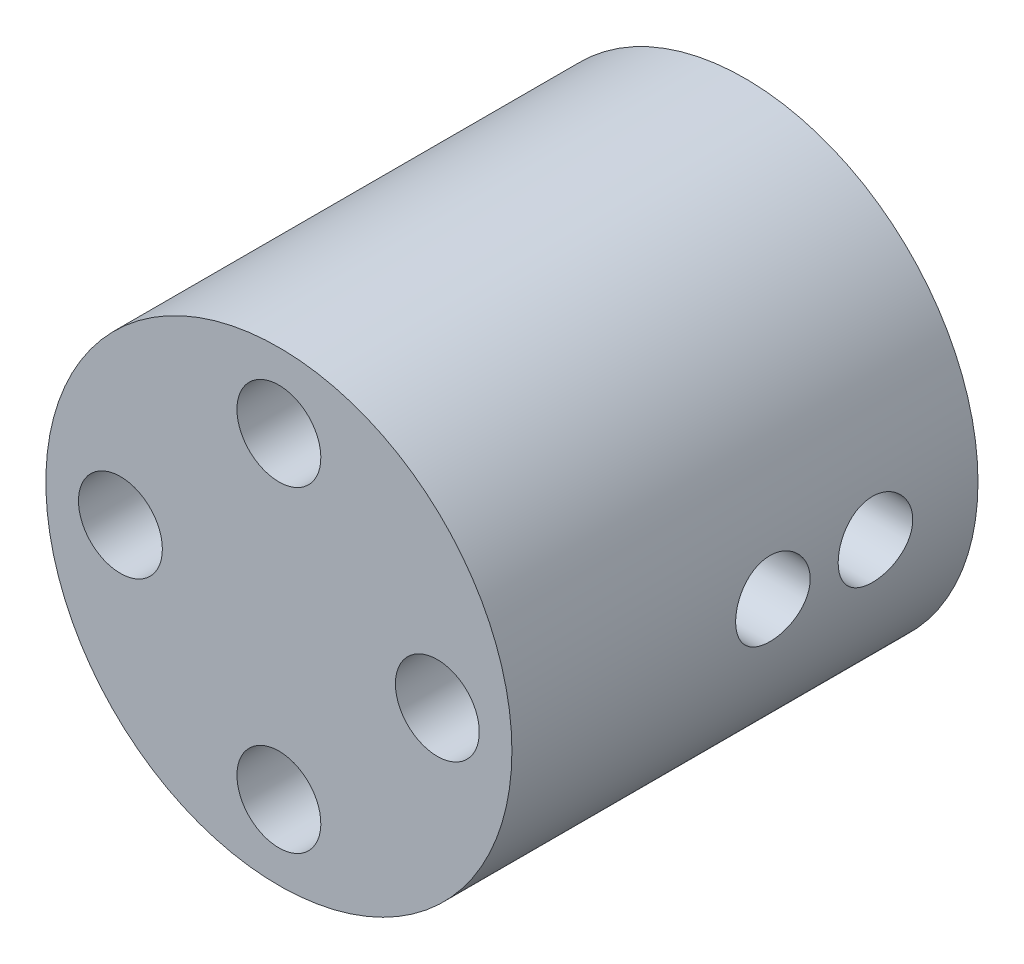
ISO-10303-21;
HEADER;
FILE_DESCRIPTION(('STEP AP214'),'2;1');
FILE_NAME('part.step','',(''),(''),'','','');
FILE_SCHEMA(('AUTOMOTIVE_DESIGN { 1 0 10303 214 1 1 1 1 }'));
ENDSEC;
DATA;
#1=APPLICATION_CONTEXT('core data for automotive mechanical design processes');
#2=APPLICATION_PROTOCOL_DEFINITION('international standard','automotive_design',2000,#1);
#3=PRODUCT_CONTEXT('',#1,'mechanical');
#4=PRODUCT('Part','Part','',(#3));
#5=PRODUCT_RELATED_PRODUCT_CATEGORY('part','',(#4));
#6=PRODUCT_DEFINITION_FORMATION('','',#4);
#7=PRODUCT_DEFINITION_CONTEXT('part definition',#1,'design');
#8=PRODUCT_DEFINITION('design','',#6,#7);
#9=PRODUCT_DEFINITION_SHAPE('','',#8);
#10=(LENGTH_UNIT() NAMED_UNIT(*) SI_UNIT(.MILLI.,.METRE.));
#11=(NAMED_UNIT(*) PLANE_ANGLE_UNIT() SI_UNIT($,.RADIAN.));
#12=(NAMED_UNIT(*) SI_UNIT($,.STERADIAN.) SOLID_ANGLE_UNIT());
#13=UNCERTAINTY_MEASURE_WITH_UNIT(LENGTH_MEASURE(1.E-05),#10,'distance_accuracy_value','');
#14=(GEOMETRIC_REPRESENTATION_CONTEXT(3) GLOBAL_UNCERTAINTY_ASSIGNED_CONTEXT((#13)) GLOBAL_UNIT_ASSIGNED_CONTEXT((#10,
#11,#12)) REPRESENTATION_CONTEXT('',''));
#15=CARTESIAN_POINT('',(0.,0.,0.));
#16=DIRECTION('',(0.,0.,1.));
#17=DIRECTION('',(1.,0.,0.));
#18=AXIS2_PLACEMENT_3D('',#15,#16,#17);
#19=CARTESIAN_POINT('',(12.5480769230769,0.,5.5));
#20=DIRECTION('',(-1.,0.,0.));
#21=DIRECTION('',(0.,0.,1.));
#22=AXIS2_PLACEMENT_3D('',#19,#20,#21);
#23=CYLINDRICAL_SURFACE('',#22,1.5);
#24=CARTESIAN_POINT('',(2.54807692307692,0.,5.5));
#25=DIRECTION('',(-1.,0.,0.));
#26=DIRECTION('',(0.,0.,1.));
#27=AXIS2_PLACEMENT_3D('',#24,#25,#26);
#28=CIRCLE('',#27,1.5);
#29=CARTESIAN_POINT('',(2.54807692307692,0.,7.));
#30=VERTEX_POINT('',#29);
#31=EDGE_CURVE('E210',#30,#30,#28,.T.);
#32=ORIENTED_EDGE('',*,*,#31,.T.);
#33=EDGE_LOOP('',(#32));
#34=FACE_BOUND('',#33,.T.);
#35=CARTESIAN_POINT('',(7.5,0.,5.5));
#36=DIRECTION('',(1.,0.,0.));
#37=DIRECTION('',(0.,0.,-1.));
#38=AXIS2_PLACEMENT_3D('',#35,#36,#37);
#39=CIRCLE('',#38,1.5);
#40=CARTESIAN_POINT('',(7.5,0.,4.));
#41=VERTEX_POINT('',#40);
#42=EDGE_CURVE('E100',#41,#41,#39,.F.);
#43=ORIENTED_EDGE('',*,*,#42,.F.);
#44=EDGE_LOOP('',(#43));
#45=FACE_BOUND('',#44,.T.);
#46=ADVANCED_FACE('F33',(#34,#45),#23,.F.);
#47=CARTESIAN_POINT('',(12.5480769230769,0.,11.));
#48=DIRECTION('',(-1.,0.,0.));
#49=DIRECTION('',(0.,0.,1.));
#50=AXIS2_PLACEMENT_3D('',#47,#48,#49);
#51=CYLINDRICAL_SURFACE('',#50,1.5);
#52=CARTESIAN_POINT('',(2.54807692307692,0.,11.));
#53=DIRECTION('',(-1.,0.,0.));
#54=DIRECTION('',(0.,0.,1.));
#55=AXIS2_PLACEMENT_3D('',#52,#53,#54);
#56=CIRCLE('',#55,1.5);
#57=CARTESIAN_POINT('',(2.54807692307692,0.,12.5));
#58=VERTEX_POINT('',#57);
#59=EDGE_CURVE('E77',#58,#58,#56,.T.);
#60=ORIENTED_EDGE('',*,*,#59,.T.);
#61=EDGE_LOOP('',(#60));
#62=FACE_BOUND('',#61,.T.);
#63=CARTESIAN_POINT('',(7.5,0.,11.));
#64=DIRECTION('',(1.,0.,0.));
#65=DIRECTION('',(0.,0.,-1.));
#66=AXIS2_PLACEMENT_3D('',#63,#64,#65);
#67=CIRCLE('',#66,1.5);
#68=CARTESIAN_POINT('',(7.5,0.,9.5));
#69=VERTEX_POINT('',#68);
#70=EDGE_CURVE('E97',#69,#69,#67,.F.);
#71=ORIENTED_EDGE('',*,*,#70,.F.);
#72=EDGE_LOOP('',(#71));
#73=FACE_BOUND('',#72,.T.);
#74=ADVANCED_FACE('F143',(#62,#73),#51,.F.);
#75=CARTESIAN_POINT('',(0.,0.,25.));
#76=DIRECTION('',(0.,0.,-1.));
#77=DIRECTION('',(-1.,0.,0.));
#78=AXIS2_PLACEMENT_3D('',#75,#76,#77);
#79=CYLINDRICAL_SURFACE('',#78,12.5);
#80=CARTESIAN_POINT('',(12.5,0.,9.));
#81=CARTESIAN_POINT('',(12.4999981342099,-0.111577020127934,9.00000452863018));
#82=CARTESIAN_POINT('',(12.4984904676373,-0.223216523860334,9.00936860729316));
#83=CARTESIAN_POINT('',(12.4926212341856,-0.443368779658238,9.04656444769798));
#84=CARTESIAN_POINT('',(12.4882569793104,-0.551878486135173,9.07441360390014));
#85=CARTESIAN_POINT('',(12.4771644640129,-0.762553771126288,9.14772088044601));
#86=CARTESIAN_POINT('',(12.4704380773984,-0.864724302944006,9.19316504612079));
#87=CARTESIAN_POINT('',(12.4553623980115,-1.05997584434546,9.30033679439778));
#88=CARTESIAN_POINT('',(12.4470133072085,-1.15305798294893,9.36206235088363));
#89=CARTESIAN_POINT('',(12.4295364290338,-1.32832749604674,9.50062560426243));
#90=CARTESIAN_POINT('',(12.4204030044304,-1.41042286652597,9.57757897894517));
#91=CARTESIAN_POINT('',(12.4024303990938,-1.56059410283783,9.74416446727497));
#92=CARTESIAN_POINT('',(12.393591236265,-1.62866911690709,9.83379735066868));
#93=CARTESIAN_POINT('',(12.377153335782,-1.74923165413214,10.0238238861521));
#94=CARTESIAN_POINT('',(12.369561883485,-1.80162899846097,10.1242754373616));
#95=CARTESIAN_POINT('',(12.3565566594955,-1.88877230962607,10.3326956628688));
#96=CARTESIAN_POINT('',(12.3511427525034,-1.92351937318009,10.4406638696375));
#97=CARTESIAN_POINT('',(12.3431614474236,-1.97408758681328,10.6600803768648));
#98=CARTESIAN_POINT('',(12.3405702530036,-1.990067044504,10.77149131095));
#99=CARTESIAN_POINT('',(12.3384556715911,-2.00313711337577,10.9954409870854));
#100=CARTESIAN_POINT('',(12.3389320844424,-2.00022895694192,11.1079796550745));
#101=CARTESIAN_POINT('',(12.3428771480604,-1.97573547058135,11.3298650304989));
#102=CARTESIAN_POINT('',(12.3463174079177,-1.95432734726414,11.439231877361));
#103=CARTESIAN_POINT('',(12.3557581320174,-1.8937194351384,11.652801071098));
#104=CARTESIAN_POINT('',(12.36175867776,-1.85451907995672,11.7570032534509));
#105=CARTESIAN_POINT('',(12.375674818266,-1.75925788747206,11.9578192678559));
#106=CARTESIAN_POINT('',(12.3835988093069,-1.70312285817509,12.0543972996854));
#107=CARTESIAN_POINT('',(12.4004630811492,-1.57563852632363,12.2368302716853));
#108=CARTESIAN_POINT('',(12.4094034376511,-1.50428809015537,12.3226844121232));
#109=CARTESIAN_POINT('',(12.4274181245254,-1.34742984087892,12.4822588004373));
#110=CARTESIAN_POINT('',(12.4364928200271,-1.26176985545599,12.5558295070688));
#111=CARTESIAN_POINT('',(12.4536592708467,-1.07924037468052,12.687574738843));
#112=CARTESIAN_POINT('',(12.4617510207175,-0.982370817216379,12.7457491786701));
#113=CARTESIAN_POINT('',(12.4760500569944,-0.780035888309119,12.845061678114));
#114=CARTESIAN_POINT('',(12.4822559575706,-0.67456426742153,12.8861872172689));
#115=CARTESIAN_POINT('',(12.492072755936,-0.45808983393977,12.950099357926));
#116=CARTESIAN_POINT('',(12.4956838535962,-0.347087448070729,12.9728873719371));
#117=CARTESIAN_POINT('',(12.4998774645506,-0.123992055401969,12.999276470013));
#118=CARTESIAN_POINT('',(12.5004923996757,-0.0119239336604374,13.0030829659577));
#119=CARTESIAN_POINT('',(12.4987129750933,0.211249371511144,12.9919476183907));
#120=CARTESIAN_POINT('',(12.4963187218055,0.322354588854289,12.9770064378887));
#121=CARTESIAN_POINT('',(12.4888100015234,0.539818798235509,12.9289707018108));
#122=CARTESIAN_POINT('',(12.4837106780256,0.646200674402084,12.8959771746954));
#123=CARTESIAN_POINT('',(12.4713614614776,0.851922990585996,12.81288053147));
#124=CARTESIAN_POINT('',(12.4641114556453,0.951263060991193,12.7627765180619));
#125=CARTESIAN_POINT('',(12.4481852151843,1.14097865112887,12.6464060006967));
#126=CARTESIAN_POINT('',(12.4394977755831,1.2312740030957,12.5800103639769));
#127=CARTESIAN_POINT('',(12.4216959541371,1.39951415639529,12.4331198456375));
#128=CARTESIAN_POINT('',(12.4125815438834,1.47745813440283,12.3526240248717));
#129=CARTESIAN_POINT('',(12.3948490273074,1.61953866530001,12.178899611896));
#130=CARTESIAN_POINT('',(12.3862364645378,1.6835368741472,12.0855572212132));
#131=CARTESIAN_POINT('',(12.3705841030174,1.7949448921012,11.8893262188797));
#132=CARTESIAN_POINT('',(12.3635442573346,1.84235519623835,11.7864378922229));
#133=CARTESIAN_POINT('',(12.3518754120478,1.91903158354154,11.5744330407818));
#134=CARTESIAN_POINT('',(12.3472370587722,1.94836814902516,11.4653425454021));
#135=CARTESIAN_POINT('',(12.3408723222072,1.9882871855446,11.243702430008));
#136=CARTESIAN_POINT('',(12.3391457074239,1.99887114748454,11.1311530857092));
#137=CARTESIAN_POINT('',(12.3388093758569,2.00094546618394,10.9071705065634));
#138=CARTESIAN_POINT('',(12.3401641282165,1.99265347821446,10.7957392804602));
#139=CARTESIAN_POINT('',(12.3457602825821,1.95768017972975,10.5758786773728));
#140=CARTESIAN_POINT('',(12.3500016772787,1.93099891577862,10.4674492927881));
#141=CARTESIAN_POINT('',(12.3608801586201,1.86008521855063,10.2567446499835));
#142=CARTESIAN_POINT('',(12.3675148843103,1.81587007770133,10.1544634423587));
#143=CARTESIAN_POINT('',(12.3824349767408,1.71116577284244,9.95873553232693));
#144=CARTESIAN_POINT('',(12.3907204147391,1.65067590624507,9.86528921156177));
#145=CARTESIAN_POINT('',(12.4081216807701,1.51435663599677,9.68878141916346));
#146=CARTESIAN_POINT('',(12.417245602178,1.43836664580959,9.60584475209958));
#147=CARTESIAN_POINT('',(12.4352300129975,1.27354334357953,9.45382461860248));
#148=CARTESIAN_POINT('',(12.44409044097,1.18470706402004,9.38474436185129));
#149=CARTESIAN_POINT('',(12.4606140562915,0.996048346577332,9.26200253382818));
#150=CARTESIAN_POINT('',(12.4682693265296,0.896160049794846,9.2084411261126));
#151=CARTESIAN_POINT('',(12.4814428750468,0.688725166968655,9.11893870710092));
#152=CARTESIAN_POINT('',(12.4869633156233,0.581186461209753,9.08297985689602));
#153=CARTESIAN_POINT('',(12.4940175589639,0.394335518838039,9.03765426126452));
#154=CARTESIAN_POINT('',(12.4962491778317,0.316163477498691,9.0235560972072));
#155=CARTESIAN_POINT('',(12.4992410506714,0.158671480151703,9.00472742713639));
#156=CARTESIAN_POINT('',(12.5000013269159,0.0793515415388269,8.99999677932082));
#157=CARTESIAN_POINT('',(12.5,0.,9.));
#158=B_SPLINE_CURVE_WITH_KNOTS('',3,(#80,#81,#82,#83,#84,#85,#86,#87,#88,#89,#90,#91,#92,#93,
#94,#95,#96,#97,#98,#99,#100,#101,#102,#103,#104,#105,#106,#107,#108,#109,#110,#111,#112,#113,
#114,#115,#116,#117,#118,#119,#120,#121,#122,#123,#124,#125,#126,#127,#128,#129,#130,#131,#132,
#133,#134,#135,#136,#137,#138,#139,#140,#141,#142,#143,#144,#145,#146,#147,#148,#149,#150,#151,
#152,#153,#154,#155,#156,#157),.UNSPECIFIED.,.T.,.F.,(4,2,2,2,2,2,2,2,2,2,2,2,2,2,2,2,2,2,2,2,2,
2,2,2,2,2,2,2,2,2,2,2,2,2,2,2,2,2,4),(0.,0.334441046622945,0.669197249319467,1.00368849765685,
1.33813814029104,1.67523334608234,2.0123490250128,2.35136809625945,2.69036609964137,
3.0264835846965,3.36257913887026,3.695490558905,4.02841257712192,4.36281487068318,
4.69724208737484,5.0354831333739,5.37372605363721,5.71221693636019,6.05068174320194,
6.38547572150114,6.72025786018134,7.05318530227048,7.38613020622256,7.72180459283845,
8.0575013456327,8.39639027086604,8.7352690818252,9.07281785760314,9.41033979575026,
9.74398956846141,10.0776384963298,10.4109591848676,10.7442942653298,11.0812763085405,
11.4183363199473,11.7575256865024,12.0963705940352,12.3342225666999,12.5720709388195),.UNSPECIFIED.);
#159=CARTESIAN_POINT('',(12.5,0.,9.));
#160=VERTEX_POINT('',#159);
#161=EDGE_CURVE('E11',#160,#160,#158,.T.);
#162=ORIENTED_EDGE('',*,*,#161,.T.);
#163=EDGE_LOOP('',(#162));
#164=FACE_BOUND('',#163,.T.);
#165=CARTESIAN_POINT('',(12.5,0.,3.5));
#166=CARTESIAN_POINT('',(12.4999981342099,-0.111577020127934,3.50000452863018));
#167=CARTESIAN_POINT('',(12.4984904676373,-0.223216523860334,3.50936860729316));
#168=CARTESIAN_POINT('',(12.4926212341856,-0.443368779658238,3.54656444769798));
#169=CARTESIAN_POINT('',(12.4882569793104,-0.551878486135174,3.57441360390014));
#170=CARTESIAN_POINT('',(12.4771644640129,-0.762553771126289,3.64772088044601));
#171=CARTESIAN_POINT('',(12.4704380773984,-0.864724302944006,3.69316504612079));
#172=CARTESIAN_POINT('',(12.4553623980115,-1.05997584434546,3.80033679439778));
#173=CARTESIAN_POINT('',(12.4470133072085,-1.15305798294893,3.86206235088363));
#174=CARTESIAN_POINT('',(12.4295364290338,-1.32832749604674,4.00062560426243));
#175=CARTESIAN_POINT('',(12.4204030044304,-1.41042286652597,4.07757897894517));
#176=CARTESIAN_POINT('',(12.4024303990938,-1.56059410283783,4.24416446727497));
#177=CARTESIAN_POINT('',(12.393591236265,-1.62866911690709,4.33379735066868));
#178=CARTESIAN_POINT('',(12.377153335782,-1.74923165413214,4.52382388615207));
#179=CARTESIAN_POINT('',(12.369561883485,-1.80162899846097,4.6242754373616));
#180=CARTESIAN_POINT('',(12.3565566594955,-1.88877230962607,4.83269566286881));
#181=CARTESIAN_POINT('',(12.3511427525034,-1.92351937318009,4.94066386963747));
#182=CARTESIAN_POINT('',(12.3431614474236,-1.97408758681328,5.16008037686482));
#183=CARTESIAN_POINT('',(12.3405702530036,-1.990067044504,5.27149131095003));
#184=CARTESIAN_POINT('',(12.3384556715911,-2.00313711337577,5.49544098708544));
#185=CARTESIAN_POINT('',(12.3389320844424,-2.00022895694192,5.60797965507451));
#186=CARTESIAN_POINT('',(12.3428771480604,-1.97573547058135,5.82986503049894));
#187=CARTESIAN_POINT('',(12.3463174079177,-1.95432734726414,5.93923187736104));
#188=CARTESIAN_POINT('',(12.3557581320174,-1.8937194351384,6.15280107109796));
#189=CARTESIAN_POINT('',(12.36175867776,-1.85451907995672,6.2570032534509));
#190=CARTESIAN_POINT('',(12.375674818266,-1.75925788747207,6.45781926785585));
#191=CARTESIAN_POINT('',(12.3835988093069,-1.70312285817509,6.55439729968538));
#192=CARTESIAN_POINT('',(12.4004630811492,-1.57563852632363,6.73683027168534));
#193=CARTESIAN_POINT('',(12.4094034376511,-1.50428809015537,6.82268441212319));
#194=CARTESIAN_POINT('',(12.4274181245254,-1.34742984087892,6.98225880043734));
#195=CARTESIAN_POINT('',(12.4364928200271,-1.26176985545599,7.05582950706879));
#196=CARTESIAN_POINT('',(12.4536592708467,-1.07924037468052,7.18757473884301));
#197=CARTESIAN_POINT('',(12.4617510207175,-0.98237081721638,7.24574917867007));
#198=CARTESIAN_POINT('',(12.4760500569944,-0.780035888309119,7.34506167811398));
#199=CARTESIAN_POINT('',(12.4822559575706,-0.674564267421531,7.38618721726887));
#200=CARTESIAN_POINT('',(12.492072755936,-0.45808983393977,7.45009935792601));
#201=CARTESIAN_POINT('',(12.4956838535962,-0.347087448070729,7.47288737193707));
#202=CARTESIAN_POINT('',(12.4998774645506,-0.123992055401969,7.49927647001296));
#203=CARTESIAN_POINT('',(12.5004923996757,-0.0119239336604371,7.50308296595766));
#204=CARTESIAN_POINT('',(12.4987129750933,0.211249371511144,7.49194761839074));
#205=CARTESIAN_POINT('',(12.4963187218055,0.322354588854289,7.47700643788865));
#206=CARTESIAN_POINT('',(12.4888100015234,0.539818798235509,7.42897070181076));
#207=CARTESIAN_POINT('',(12.4837106780256,0.646200674402084,7.39597717469545));
#208=CARTESIAN_POINT('',(12.4713614614776,0.851922990585996,7.31288053146995));
#209=CARTESIAN_POINT('',(12.4641114556453,0.951263060991193,7.2627765180619));
#210=CARTESIAN_POINT('',(12.4481852151843,1.14097865112887,7.14640600069669));
#211=CARTESIAN_POINT('',(12.4394977755831,1.2312740030957,7.08001036397693));
#212=CARTESIAN_POINT('',(12.4216959541371,1.39951415639529,6.93311984563749));
#213=CARTESIAN_POINT('',(12.4125815438834,1.47745813440283,6.85262402487175));
#214=CARTESIAN_POINT('',(12.3948490273073,1.61953866530001,6.67889961189604));
#215=CARTESIAN_POINT('',(12.3862364645378,1.6835368741472,6.58555722121318));
#216=CARTESIAN_POINT('',(12.3705841030174,1.7949448921012,6.38932621887967));
#217=CARTESIAN_POINT('',(12.3635442573346,1.84235519623835,6.2864378922229));
#218=CARTESIAN_POINT('',(12.3518754120478,1.91903158354154,6.07443304078179));
#219=CARTESIAN_POINT('',(12.3472370587722,1.94836814902516,5.96534254540213));
#220=CARTESIAN_POINT('',(12.3408723222072,1.9882871855446,5.74370243000799));
#221=CARTESIAN_POINT('',(12.3391457074239,1.99887114748454,5.63115308570916));
#222=CARTESIAN_POINT('',(12.3388093758569,2.00094546618394,5.40717050656338));
#223=CARTESIAN_POINT('',(12.3401641282165,1.99265347821446,5.29573928046024));
#224=CARTESIAN_POINT('',(12.3457602825821,1.95768017972975,5.07587867737277));
#225=CARTESIAN_POINT('',(12.3500016772787,1.93099891577862,4.96744929278811));
#226=CARTESIAN_POINT('',(12.3608801586201,1.86008521855063,4.75674464998353));
#227=CARTESIAN_POINT('',(12.3675148843103,1.81587007770134,4.65446344235868));
#228=CARTESIAN_POINT('',(12.3824349767408,1.71116577284244,4.45873553232693));
#229=CARTESIAN_POINT('',(12.3907204147391,1.65067590624507,4.36528921156177));
#230=CARTESIAN_POINT('',(12.4081216807701,1.51435663599677,4.18878141916346));
#231=CARTESIAN_POINT('',(12.417245602178,1.43836664580959,4.10584475209958));
#232=CARTESIAN_POINT('',(12.4352300129975,1.27354334357953,3.95382461860248));
#233=CARTESIAN_POINT('',(12.44409044097,1.18470706402005,3.88474436185129));
#234=CARTESIAN_POINT('',(12.4606140562915,0.996048346577332,3.76200253382818));
#235=CARTESIAN_POINT('',(12.4682693265296,0.896160049794845,3.7084411261126));
#236=CARTESIAN_POINT('',(12.4814428750468,0.688725166968654,3.61893870710092));
#237=CARTESIAN_POINT('',(12.4869633156233,0.581186461209753,3.58297985689603));
#238=CARTESIAN_POINT('',(12.4940175589639,0.394335518838039,3.53765426126452));
#239=CARTESIAN_POINT('',(12.4962491778317,0.316163477498691,3.5235560972072));
#240=CARTESIAN_POINT('',(12.4992410506714,0.158671480151703,3.50472742713639));
#241=CARTESIAN_POINT('',(12.5000013269159,0.079351541538827,3.49999677932082));
#242=CARTESIAN_POINT('',(12.5,0.,3.5));
#243=B_SPLINE_CURVE_WITH_KNOTS('',3,(#165,#166,#167,#168,#169,#170,#171,#172,#173,#174,#175,
#176,#177,#178,#179,#180,#181,#182,#183,#184,#185,#186,#187,#188,#189,#190,#191,#192,#193,#194,
#195,#196,#197,#198,#199,#200,#201,#202,#203,#204,#205,#206,#207,#208,#209,#210,#211,#212,#213,
#214,#215,#216,#217,#218,#219,#220,#221,#222,#223,#224,#225,#226,#227,#228,#229,#230,#231,#232,
#233,#234,#235,#236,#237,#238,#239,#240,#241,#242),.UNSPECIFIED.,.T.,.F.,(4,2,2,2,2,2,2,2,2,2,2,
2,2,2,2,2,2,2,2,2,2,2,2,2,2,2,2,2,2,2,2,2,2,2,2,2,2,2,4),(0.,0.334441046622945,
0.669197249319467,1.00368849765685,1.33813814029104,1.67523334608234,2.0123490250128,
2.35136809625945,2.69036609964137,3.0264835846965,3.36257913887026,3.695490558905,
4.02841257712192,4.36281487068318,4.69724208737484,5.0354831333739,5.37372605363721,
5.71221693636019,6.05068174320194,6.38547572150114,6.72025786018134,7.05318530227048,
7.38613020622256,7.72180459283845,8.0575013456327,8.39639027086604,8.73526908182521,
9.07281785760314,9.41033979575026,9.74398956846141,10.0776384963298,10.4109591848676,
10.7442942653298,11.0812763085405,11.4183363199473,11.7575256865024,12.0963705940352,
12.3342225666999,12.5720709388195),.UNSPECIFIED.);
#244=CARTESIAN_POINT('',(12.5,0.,3.5));
#245=VERTEX_POINT('',#244);
#246=EDGE_CURVE('E46',#245,#245,#243,.T.);
#247=ORIENTED_EDGE('',*,*,#246,.T.);
#248=EDGE_LOOP('',(#247));
#249=FACE_BOUND('',#248,.T.);
#250=CARTESIAN_POINT('',(0.,0.,25.));
#251=DIRECTION('',(0.,0.,1.));
#252=DIRECTION('',(1.,0.,0.));
#253=AXIS2_PLACEMENT_3D('',#250,#251,#252);
#254=CIRCLE('',#253,12.5);
#255=CARTESIAN_POINT('',(12.5,0.,25.));
#256=VERTEX_POINT('',#255);
#257=EDGE_CURVE('E92',#256,#256,#254,.T.);
#258=ORIENTED_EDGE('',*,*,#257,.F.);
#259=EDGE_LOOP('',(#258));
#260=FACE_BOUND('',#259,.T.);
#261=CARTESIAN_POINT('',(0.,0.,0.));
#262=DIRECTION('',(0.,0.,1.));
#263=DIRECTION('',(1.,0.,0.));
#264=AXIS2_PLACEMENT_3D('',#261,#262,#263);
#265=CIRCLE('',#264,12.5);
#266=CARTESIAN_POINT('',(12.5,0.,0.));
#267=VERTEX_POINT('',#266);
#268=EDGE_CURVE('E90',#267,#267,#265,.T.);
#269=ORIENTED_EDGE('',*,*,#268,.T.);
#270=EDGE_LOOP('',(#269));
#271=FACE_BOUND('',#270,.T.);
#272=ADVANCED_FACE('F35',(#164,#249,#260,#271),#79,.T.);
#273=CARTESIAN_POINT('',(0.,0.,25.));
#274=DIRECTION('',(0.,0.,1.));
#275=DIRECTION('',(1.,0.,0.));
#276=AXIS2_PLACEMENT_3D('',#273,#274,#275);
#277=PLANE('',#276);
#278=CARTESIAN_POINT('',(0.,-8.5,25.));
#279=DIRECTION('',(0.,0.,1.));
#280=DIRECTION('',(0.,1.,0.));
#281=AXIS2_PLACEMENT_3D('',#278,#279,#280);
#282=CIRCLE('',#281,2.25);
#283=CARTESIAN_POINT('',(0.,-6.25,25.));
#284=VERTEX_POINT('',#283);
#285=EDGE_CURVE('E211',#284,#284,#282,.T.);
#286=ORIENTED_EDGE('',*,*,#285,.F.);
#287=EDGE_LOOP('',(#286));
#288=FACE_BOUND('',#287,.T.);
#289=CARTESIAN_POINT('',(8.5,0.,25.));
#290=DIRECTION('',(0.,0.,1.));
#291=DIRECTION('',(-1.,0.,0.));
#292=AXIS2_PLACEMENT_3D('',#289,#290,#291);
#293=CIRCLE('',#292,2.25);
#294=CARTESIAN_POINT('',(6.25,0.,25.));
#295=VERTEX_POINT('',#294);
#296=EDGE_CURVE('E217',#295,#295,#293,.T.);
#297=ORIENTED_EDGE('',*,*,#296,.F.);
#298=EDGE_LOOP('',(#297));
#299=FACE_BOUND('',#298,.T.);
#300=CARTESIAN_POINT('',(0.,8.5,25.));
#301=DIRECTION('',(0.,0.,1.));
#302=DIRECTION('',(0.,-1.,0.));
#303=AXIS2_PLACEMENT_3D('',#300,#301,#302);
#304=CIRCLE('',#303,2.25);
#305=CARTESIAN_POINT('',(0.,6.25,25.));
#306=VERTEX_POINT('',#305);
#307=EDGE_CURVE('E103',#306,#306,#304,.T.);
#308=ORIENTED_EDGE('',*,*,#307,.F.);
#309=EDGE_LOOP('',(#308));
#310=FACE_BOUND('',#309,.T.);
#311=CARTESIAN_POINT('',(-8.5,0.,25.));
#312=DIRECTION('',(0.,0.,1.));
#313=DIRECTION('',(1.,0.,0.));
#314=AXIS2_PLACEMENT_3D('',#311,#312,#313);
#315=CIRCLE('',#314,2.25);
#316=CARTESIAN_POINT('',(-6.25,0.,25.));
#317=VERTEX_POINT('',#316);
#318=EDGE_CURVE('E80',#317,#317,#315,.T.);
#319=ORIENTED_EDGE('',*,*,#318,.F.);
#320=EDGE_LOOP('',(#319));
#321=FACE_BOUND('',#320,.T.);
#322=ORIENTED_EDGE('',*,*,#257,.T.);
#323=EDGE_LOOP('',(#322));
#324=FACE_BOUND('',#323,.T.);
#325=ADVANCED_FACE('F169',(#288,#299,#310,#321,#324),#277,.T.);
#326=CARTESIAN_POINT('',(0.,0.,0.));
#327=DIRECTION('',(0.,0.,1.));
#328=DIRECTION('',(1.,0.,0.));
#329=AXIS2_PLACEMENT_3D('',#326,#327,#328);
#330=PLANE('',#329);
#331=CARTESIAN_POINT('',(0.,0.,0.));
#332=DIRECTION('',(0.,0.,-1.));
#333=DIRECTION('',(-1.,0.,0.));
#334=AXIS2_PLACEMENT_3D('',#331,#332,#333);
#335=CIRCLE('',#334,3.125);
#336=CARTESIAN_POINT('',(-3.125,0.,0.));
#337=VERTEX_POINT('',#336);
#338=EDGE_CURVE('E72',#337,#337,#335,.T.);
#339=ORIENTED_EDGE('',*,*,#338,.F.);
#340=EDGE_LOOP('',(#339));
#341=FACE_BOUND('',#340,.T.);
#342=ORIENTED_EDGE('',*,*,#268,.F.);
#343=EDGE_LOOP('',(#342));
#344=FACE_BOUND('',#343,.T.);
#345=ADVANCED_FACE('F167',(#341,#344),#330,.F.);
#346=CARTESIAN_POINT('',(-8.5,0.,15.));
#347=DIRECTION('',(0.,0.,1.));
#348=DIRECTION('',(1.,0.,0.));
#349=AXIS2_PLACEMENT_3D('',#346,#347,#348);
#350=CYLINDRICAL_SURFACE('',#349,2.25);
#351=CARTESIAN_POINT('',(-8.5,0.,15.));
#352=DIRECTION('',(0.,0.,1.));
#353=DIRECTION('',(1.,0.,0.));
#354=AXIS2_PLACEMENT_3D('',#351,#352,#353);
#355=CIRCLE('',#354,2.25);
#356=CARTESIAN_POINT('',(-6.25,0.,15.));
#357=VERTEX_POINT('',#356);
#358=EDGE_CURVE('E83',#357,#357,#355,.T.);
#359=ORIENTED_EDGE('',*,*,#358,.F.);
#360=EDGE_LOOP('',(#359));
#361=FACE_BOUND('',#360,.T.);
#362=ORIENTED_EDGE('',*,*,#318,.T.);
#363=EDGE_LOOP('',(#362));
#364=FACE_BOUND('',#363,.T.);
#365=ADVANCED_FACE('F163',(#361,#364),#350,.F.);
#366=CARTESIAN_POINT('',(-8.5,0.,15.));
#367=DIRECTION('',(0.,0.,1.));
#368=DIRECTION('',(1.,0.,0.));
#369=AXIS2_PLACEMENT_3D('',#366,#367,#368);
#370=PLANE('',#369);
#371=ORIENTED_EDGE('',*,*,#358,.T.);
#372=EDGE_LOOP('',(#371));
#373=FACE_BOUND('',#372,.T.);
#374=ADVANCED_FACE('F160',(#373),#370,.T.);
#375=CARTESIAN_POINT('',(0.,0.,3.));
#376=DIRECTION('',(0.,0.,-1.));
#377=DIRECTION('',(-1.,0.,0.));
#378=AXIS2_PLACEMENT_3D('',#375,#376,#377);
#379=CYLINDRICAL_SURFACE('',#378,3.125);
#380=CARTESIAN_POINT('',(0.,0.,3.));
#381=DIRECTION('',(0.,0.,-1.));
#382=DIRECTION('',(-1.,0.,0.));
#383=AXIS2_PLACEMENT_3D('',#380,#381,#382);
#384=CIRCLE('',#383,3.125);
#385=CARTESIAN_POINT('',(2.54807692307692,1.80912381944488,3.));
#386=VERTEX_POINT('',#385);
#387=CARTESIAN_POINT('',(2.54807692307692,-1.80912381944488,3.));
#388=VERTEX_POINT('',#387);
#389=EDGE_CURVE('E68',#386,#388,#384,.T.);
#390=ORIENTED_EDGE('',*,*,#389,.F.);
#391=DIRECTION('',(0.,0.,-1.));
#392=VECTOR('',#391,1.);
#393=CARTESIAN_POINT('',(2.54807692307692,1.80912381944488,15.));
#394=LINE('',#393,#392);
#395=CARTESIAN_POINT('',(2.54807692307692,1.80912381944488,15.));
#396=VERTEX_POINT('',#395);
#397=EDGE_CURVE('E53',#396,#386,#394,.T.);
#398=ORIENTED_EDGE('',*,*,#397,.F.);
#399=CARTESIAN_POINT('',(0.,0.,15.));
#400=DIRECTION('',(0.,0.,-1.));
#401=DIRECTION('',(-1.,0.,0.));
#402=AXIS2_PLACEMENT_3D('',#399,#400,#401);
#403=CIRCLE('',#402,3.125);
#404=CARTESIAN_POINT('',(2.54807692307692,-1.80912381944488,15.));
#405=VERTEX_POINT('',#404);
#406=EDGE_CURVE('E70',#405,#396,#403,.T.);
#407=ORIENTED_EDGE('',*,*,#406,.F.);
#408=DIRECTION('',(0.,0.,-1.));
#409=VECTOR('',#408,1.);
#410=CARTESIAN_POINT('',(2.54807692307692,-1.80912381944488,15.));
#411=LINE('',#410,#409);
#412=EDGE_CURVE('E59',#405,#388,#411,.T.);
#413=ORIENTED_EDGE('',*,*,#412,.T.);
#414=EDGE_LOOP('',(#390,#398,#407,#413));
#415=FACE_BOUND('',#414,.T.);
#416=ORIENTED_EDGE('',*,*,#338,.T.);
#417=EDGE_LOOP('',(#416));
#418=FACE_BOUND('',#417,.T.);
#419=ADVANCED_FACE('F65',(#415,#418),#379,.F.);
#420=CARTESIAN_POINT('',(0.,0.,3.));
#421=DIRECTION('',(0.,0.,-1.));
#422=DIRECTION('',(-1.,0.,0.));
#423=AXIS2_PLACEMENT_3D('',#420,#421,#422);
#424=PLANE('',#423);
#425=DIRECTION('',(0.,-1.,0.));
#426=VECTOR('',#425,1.);
#427=CARTESIAN_POINT('',(2.54807692307692,-1.80912381944488,3.));
#428=LINE('',#427,#426);
#429=EDGE_CURVE('E74',#386,#388,#428,.T.);
#430=ORIENTED_EDGE('',*,*,#429,.F.);
#431=ORIENTED_EDGE('',*,*,#389,.T.);
#432=EDGE_LOOP('',(#430,#431));
#433=FACE_BOUND('',#432,.T.);
#434=ADVANCED_FACE('F79',(#433),#424,.T.);
#435=CARTESIAN_POINT('',(2.54807692307692,-1.80912381944488,15.));
#436=DIRECTION('',(1.,0.,0.));
#437=DIRECTION('',(0.,0.,-1.));
#438=AXIS2_PLACEMENT_3D('',#435,#436,#437);
#439=PLANE('',#438);
#440=ORIENTED_EDGE('',*,*,#59,.F.);
#441=EDGE_LOOP('',(#440));
#442=FACE_BOUND('',#441,.T.);
#443=ORIENTED_EDGE('',*,*,#31,.F.);
#444=EDGE_LOOP('',(#443));
#445=FACE_BOUND('',#444,.T.);
#446=ORIENTED_EDGE('',*,*,#429,.T.);
#447=ORIENTED_EDGE('',*,*,#412,.F.);
#448=DIRECTION('',(0.,-1.,0.));
#449=VECTOR('',#448,1.);
#450=CARTESIAN_POINT('',(2.54807692307692,-1.80912381944488,15.));
#451=LINE('',#450,#449);
#452=EDGE_CURVE('E230',#396,#405,#451,.T.);
#453=ORIENTED_EDGE('',*,*,#452,.F.);
#454=ORIENTED_EDGE('',*,*,#397,.T.);
#455=EDGE_LOOP('',(#446,#447,#453,#454));
#456=FACE_BOUND('',#455,.T.);
#457=ADVANCED_FACE('F75',(#442,#445,#456),#439,.F.);
#458=CARTESIAN_POINT('',(0.,0.,15.));
#459=DIRECTION('',(0.,0.,-1.));
#460=DIRECTION('',(-1.,0.,0.));
#461=AXIS2_PLACEMENT_3D('',#458,#459,#460);
#462=PLANE('',#461);
#463=ORIENTED_EDGE('',*,*,#406,.T.);
#464=ORIENTED_EDGE('',*,*,#452,.T.);
#465=EDGE_LOOP('',(#463,#464));
#466=FACE_BOUND('',#465,.T.);
#467=ADVANCED_FACE('F141',(#466),#462,.T.);
#468=CARTESIAN_POINT('',(0.,8.5,15.));
#469=DIRECTION('',(0.,0.,1.));
#470=DIRECTION('',(1.,0.,0.));
#471=AXIS2_PLACEMENT_3D('',#468,#469,#470);
#472=CYLINDRICAL_SURFACE('',#471,2.25);
#473=CARTESIAN_POINT('',(0.,8.5,15.));
#474=DIRECTION('',(0.,0.,1.));
#475=DIRECTION('',(0.,-1.,0.));
#476=AXIS2_PLACEMENT_3D('',#473,#474,#475);
#477=CIRCLE('',#476,2.25);
#478=CARTESIAN_POINT('',(0.,6.25,15.));
#479=VERTEX_POINT('',#478);
#480=EDGE_CURVE('E220',#479,#479,#477,.T.);
#481=ORIENTED_EDGE('',*,*,#480,.F.);
#482=EDGE_LOOP('',(#481));
#483=FACE_BOUND('',#482,.T.);
#484=ORIENTED_EDGE('',*,*,#307,.T.);
#485=EDGE_LOOP('',(#484));
#486=FACE_BOUND('',#485,.T.);
#487=ADVANCED_FACE('F137',(#483,#486),#472,.F.);
#488=CARTESIAN_POINT('',(0.,8.5,15.));
#489=DIRECTION('',(0.,0.,1.));
#490=DIRECTION('',(0.,-1.,0.));
#491=AXIS2_PLACEMENT_3D('',#488,#489,#490);
#492=PLANE('',#491);
#493=ORIENTED_EDGE('',*,*,#480,.T.);
#494=EDGE_LOOP('',(#493));
#495=FACE_BOUND('',#494,.T.);
#496=ADVANCED_FACE('F133',(#495),#492,.T.);
#497=CARTESIAN_POINT('',(8.5,0.,15.));
#498=DIRECTION('',(0.,0.,1.));
#499=DIRECTION('',(1.,0.,0.));
#500=AXIS2_PLACEMENT_3D('',#497,#498,#499);
#501=CYLINDRICAL_SURFACE('',#500,2.25);
#502=CARTESIAN_POINT('',(8.5,0.,15.));
#503=DIRECTION('',(0.,0.,1.));
#504=DIRECTION('',(-1.,0.,0.));
#505=AXIS2_PLACEMENT_3D('',#502,#503,#504);
#506=CIRCLE('',#505,2.25);
#507=CARTESIAN_POINT('',(6.25,0.,15.));
#508=VERTEX_POINT('',#507);
#509=EDGE_CURVE('E214',#508,#508,#506,.T.);
#510=ORIENTED_EDGE('',*,*,#509,.F.);
#511=EDGE_LOOP('',(#510));
#512=FACE_BOUND('',#511,.T.);
#513=ORIENTED_EDGE('',*,*,#296,.T.);
#514=EDGE_LOOP('',(#513));
#515=FACE_BOUND('',#514,.T.);
#516=ADVANCED_FACE('F129',(#512,#515),#501,.F.);
#517=CARTESIAN_POINT('',(8.5,0.,15.));
#518=DIRECTION('',(0.,0.,1.));
#519=DIRECTION('',(-1.,0.,0.));
#520=AXIS2_PLACEMENT_3D('',#517,#518,#519);
#521=PLANE('',#520);
#522=ORIENTED_EDGE('',*,*,#509,.T.);
#523=EDGE_LOOP('',(#522));
#524=FACE_BOUND('',#523,.T.);
#525=ADVANCED_FACE('F125',(#524),#521,.T.);
#526=CARTESIAN_POINT('',(0.,-8.5,15.));
#527=DIRECTION('',(0.,0.,1.));
#528=DIRECTION('',(1.,0.,0.));
#529=AXIS2_PLACEMENT_3D('',#526,#527,#528);
#530=CYLINDRICAL_SURFACE('',#529,2.25);
#531=CARTESIAN_POINT('',(0.,-8.5,15.));
#532=DIRECTION('',(0.,0.,1.));
#533=DIRECTION('',(0.,1.,0.));
#534=AXIS2_PLACEMENT_3D('',#531,#532,#533);
#535=CIRCLE('',#534,2.25);
#536=CARTESIAN_POINT('',(0.,-6.25,15.));
#537=VERTEX_POINT('',#536);
#538=EDGE_CURVE('E207',#537,#537,#535,.T.);
#539=ORIENTED_EDGE('',*,*,#538,.F.);
#540=EDGE_LOOP('',(#539));
#541=FACE_BOUND('',#540,.T.);
#542=ORIENTED_EDGE('',*,*,#285,.T.);
#543=EDGE_LOOP('',(#542));
#544=FACE_BOUND('',#543,.T.);
#545=ADVANCED_FACE('F121',(#541,#544),#530,.F.);
#546=CARTESIAN_POINT('',(0.,-8.5,15.));
#547=DIRECTION('',(0.,0.,1.));
#548=DIRECTION('',(0.,1.,0.));
#549=AXIS2_PLACEMENT_3D('',#546,#547,#548);
#550=PLANE('',#549);
#551=ORIENTED_EDGE('',*,*,#538,.T.);
#552=EDGE_LOOP('',(#551));
#553=FACE_BOUND('',#552,.T.);
#554=ADVANCED_FACE('F117',(#553),#550,.T.);
#555=CARTESIAN_POINT('',(7.5,0.,11.));
#556=DIRECTION('',(1.,0.,0.));
#557=DIRECTION('',(0.,0.,-1.));
#558=AXIS2_PLACEMENT_3D('',#555,#556,#557);
#559=CYLINDRICAL_SURFACE('',#558,2.);
#560=CARTESIAN_POINT('',(7.5,0.,11.));
#561=DIRECTION('',(1.,0.,0.));
#562=DIRECTION('',(0.,0.,-1.));
#563=AXIS2_PLACEMENT_3D('',#560,#561,#562);
#564=CIRCLE('',#563,2.);
#565=CARTESIAN_POINT('',(7.5,0.,9.));
#566=VERTEX_POINT('',#565);
#567=EDGE_CURVE('E101',#566,#566,#564,.T.);
#568=ORIENTED_EDGE('',*,*,#567,.F.);
#569=EDGE_LOOP('',(#568));
#570=FACE_BOUND('',#569,.T.);
#571=ORIENTED_EDGE('',*,*,#161,.F.);
#572=EDGE_LOOP('',(#571));
#573=FACE_BOUND('',#572,.T.);
#574=ADVANCED_FACE('F120',(#570,#573),#559,.F.);
#575=CARTESIAN_POINT('',(7.5,0.,11.));
#576=DIRECTION('',(1.,0.,0.));
#577=DIRECTION('',(0.,0.,-1.));
#578=AXIS2_PLACEMENT_3D('',#575,#576,#577);
#579=PLANE('',#578);
#580=ORIENTED_EDGE('',*,*,#567,.T.);
#581=EDGE_LOOP('',(#580));
#582=FACE_BOUND('',#581,.T.);
#583=ORIENTED_EDGE('',*,*,#70,.T.);
#584=EDGE_LOOP('',(#583));
#585=FACE_BOUND('',#584,.T.);
#586=ADVANCED_FACE('F115',(#582,#585),#579,.T.);
#587=CARTESIAN_POINT('',(7.5,0.,5.5));
#588=DIRECTION('',(1.,0.,0.));
#589=DIRECTION('',(0.,0.,-1.));
#590=AXIS2_PLACEMENT_3D('',#587,#588,#589);
#591=CYLINDRICAL_SURFACE('',#590,2.);
#592=CARTESIAN_POINT('',(7.5,0.,5.5));
#593=DIRECTION('',(1.,0.,0.));
#594=DIRECTION('',(0.,0.,-1.));
#595=AXIS2_PLACEMENT_3D('',#592,#593,#594);
#596=CIRCLE('',#595,2.);
#597=CARTESIAN_POINT('',(7.5,0.,3.5));
#598=VERTEX_POINT('',#597);
#599=EDGE_CURVE('E202',#598,#598,#596,.T.);
#600=ORIENTED_EDGE('',*,*,#599,.F.);
#601=EDGE_LOOP('',(#600));
#602=FACE_BOUND('',#601,.T.);
#603=ORIENTED_EDGE('',*,*,#246,.F.);
#604=EDGE_LOOP('',(#603));
#605=FACE_BOUND('',#604,.T.);
#606=ADVANCED_FACE('F109',(#602,#605),#591,.F.);
#607=CARTESIAN_POINT('',(7.5,0.,5.5));
#608=DIRECTION('',(1.,0.,0.));
#609=DIRECTION('',(0.,0.,-1.));
#610=AXIS2_PLACEMENT_3D('',#607,#608,#609);
#611=PLANE('',#610);
#612=ORIENTED_EDGE('',*,*,#599,.T.);
#613=EDGE_LOOP('',(#612));
#614=FACE_BOUND('',#613,.T.);
#615=ORIENTED_EDGE('',*,*,#42,.T.);
#616=EDGE_LOOP('',(#615));
#617=FACE_BOUND('',#616,.T.);
#618=ADVANCED_FACE('F114',(#614,#617),#611,.T.);
#619=CLOSED_SHELL('',(#46,#74,#272,#325,#345,#365,#374,#419,#434,#457,#467,#487,#496,#516,#525,
#545,#554,#574,#586,#606,#618));
#620=MANIFOLD_SOLID_BREP('B2',#619);
#621=ADVANCED_BREP_SHAPE_REPRESENTATION('',(#18,#620),#14);
#622=SHAPE_DEFINITION_REPRESENTATION(#9,#621);
ENDSEC;
END-ISO-10303-21;
